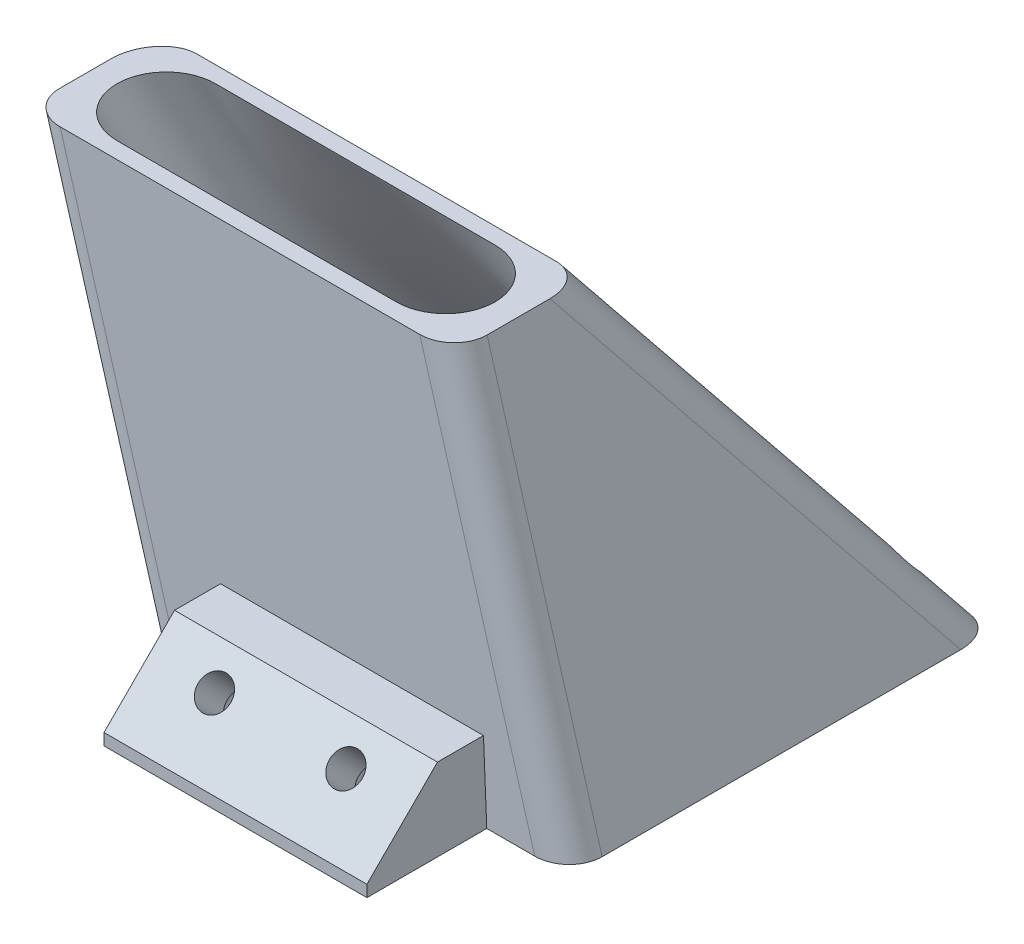
ISO-10303-21;
HEADER;
FILE_DESCRIPTION(('STEP AP214'),'2;1');
FILE_NAME('part.step','',(''),(''),'','','');
FILE_SCHEMA(('AUTOMOTIVE_DESIGN { 1 0 10303 214 1 1 1 1 }'));
ENDSEC;
DATA;
#1=APPLICATION_CONTEXT('core data for automotive mechanical design processes');
#2=APPLICATION_PROTOCOL_DEFINITION('international standard','automotive_design',2000,#1);
#3=PRODUCT_CONTEXT('',#1,'mechanical');
#4=PRODUCT('Part','Part','',(#3));
#5=PRODUCT_RELATED_PRODUCT_CATEGORY('part','',(#4));
#6=PRODUCT_DEFINITION_FORMATION('','',#4);
#7=PRODUCT_DEFINITION_CONTEXT('part definition',#1,'design');
#8=PRODUCT_DEFINITION('design','',#6,#7);
#9=PRODUCT_DEFINITION_SHAPE('','',#8);
#10=(LENGTH_UNIT() NAMED_UNIT(*) SI_UNIT(.MILLI.,.METRE.));
#11=(NAMED_UNIT(*) PLANE_ANGLE_UNIT() SI_UNIT($,.RADIAN.));
#12=(NAMED_UNIT(*) SI_UNIT($,.STERADIAN.) SOLID_ANGLE_UNIT());
#13=UNCERTAINTY_MEASURE_WITH_UNIT(LENGTH_MEASURE(1.E-05),#10,'distance_accuracy_value','');
#14=(GEOMETRIC_REPRESENTATION_CONTEXT(3) GLOBAL_UNCERTAINTY_ASSIGNED_CONTEXT((#13)) GLOBAL_UNIT_ASSIGNED_CONTEXT((#10,
#11,#12)) REPRESENTATION_CONTEXT('',''));
#15=CARTESIAN_POINT('',(0.,0.,0.));
#16=DIRECTION('',(0.,0.,1.));
#17=DIRECTION('',(1.,0.,0.));
#18=AXIS2_PLACEMENT_3D('',#15,#16,#17);
#19=CARTESIAN_POINT('',(0.,25.,0.));
#20=DIRECTION('',(0.,-1.,0.));
#21=DIRECTION('',(0.,0.,-1.));
#22=AXIS2_PLACEMENT_3D('',#19,#20,#21);
#23=PLANE('',#22);
#24=DIRECTION('',(-1.,0.,0.));
#25=VECTOR('',#24,1.);
#26=CARTESIAN_POINT('',(-14.5,25.,12.9999999999999));
#27=LINE('',#26,#25);
#28=CARTESIAN_POINT('',(2.49999999820458,25.,12.9999999999999));
#29=VERTEX_POINT('',#28);
#30=CARTESIAN_POINT('',(-14.5,25.,12.9999999999999));
#31=VERTEX_POINT('',#30);
#32=EDGE_CURVE('E332',#29,#31,#27,.T.);
#33=ORIENTED_EDGE('',*,*,#32,.T.);
#34=CARTESIAN_POINT('',(-14.5,25.,9.99999999999991));
#35=DIRECTION('',(0.,-1.,0.));
#36=DIRECTION('',(0.,0.,1.));
#37=AXIS2_PLACEMENT_3D('',#34,#35,#36);
#38=CIRCLE('',#37,3.00000000000001);
#39=CARTESIAN_POINT('',(-14.4999999998171,25.,6.99999999999991));
#40=VERTEX_POINT('',#39);
#41=EDGE_CURVE('E426',#31,#40,#38,.T.);
#42=ORIENTED_EDGE('',*,*,#41,.T.);
#43=DIRECTION('',(1.,0.,0.));
#44=VECTOR('',#43,1.);
#45=CARTESIAN_POINT('',(-14.5,25.,6.99999999999991));
#46=LINE('',#45,#44);
#47=CARTESIAN_POINT('',(2.49999999999999,25.,6.9999999999999));
#48=VERTEX_POINT('',#47);
#49=EDGE_CURVE('E430',#40,#48,#46,.T.);
#50=ORIENTED_EDGE('',*,*,#49,.T.);
#51=CARTESIAN_POINT('',(2.5,25.,9.99999999999991));
#52=DIRECTION('',(0.,-1.,0.));
#53=DIRECTION('',(0.,0.,1.));
#54=AXIS2_PLACEMENT_3D('',#51,#52,#53);
#55=CIRCLE('',#54,3.00000000000001);
#56=EDGE_CURVE('E425',#48,#29,#55,.T.);
#57=ORIENTED_EDGE('',*,*,#56,.T.);
#58=EDGE_LOOP('',(#33,#42,#50,#57));
#59=FACE_BOUND('',#58,.T.);
#60=DIRECTION('',(-1.,0.,0.));
#61=VECTOR('',#60,1.);
#62=CARTESIAN_POINT('',(7.,25.,13.9999999999999));
#63=LINE('',#62,#61);
#64=CARTESIAN_POINT('',(4.92402172044335,25.,13.9999999999999));
#65=VERTEX_POINT('',#64);
#66=CARTESIAN_POINT('',(-16.9623910372583,25.,13.9999999999999));
#67=VERTEX_POINT('',#66);
#68=EDGE_CURVE('E453',#65,#67,#63,.T.);
#69=ORIENTED_EDGE('',*,*,#68,.F.);
#70=CARTESIAN_POINT('',(4.94320637885081,25.,11.9984006394884));
#71=DIRECTION('',(0.,1.,0.));
#72=DIRECTION('',(-0.986393923832146,0.,0.164398987305344));
#73=AXIS2_PLACEMENT_3D('',#70,#71,#72);
#74=ELLIPSE('',#73,2.05834885284298,2.);
#75=CARTESIAN_POINT('',(7.,25.,11.9797308032904));
#76=VERTEX_POINT('',#75);
#77=EDGE_CURVE('E854',#76,#65,#74,.F.);
#78=ORIENTED_EDGE('',*,*,#77,.F.);
#79=DIRECTION('',(0.,0.,1.));
#80=VECTOR('',#79,1.);
#81=CARTESIAN_POINT('',(7.,25.,13.9999999999999));
#82=LINE('',#81,#80);
#83=CARTESIAN_POINT('',(7.,25.,8.15732406713463));
#84=VERTEX_POINT('',#83);
#85=EDGE_CURVE('E424',#84,#76,#82,.T.);
#86=ORIENTED_EDGE('',*,*,#85,.F.);
#87=CARTESIAN_POINT('',(4.94320637885081,25.,8.51205095489713));
#88=DIRECTION('',(0.,1.,0.));
#89=DIRECTION('',(-0.301131367937099,0.,0.953582665134141));
#90=AXIS2_PLACEMENT_3D('',#87,#88,#89);
#91=ELLIPSE('',#90,2.55749877810332,2.);
#92=CARTESIAN_POINT('',(5.23364634726691,25.,5.99999999999992));
#93=VERTEX_POINT('',#92);
#94=EDGE_CURVE('E857',#93,#84,#91,.F.);
#95=ORIENTED_EDGE('',*,*,#94,.F.);
#96=DIRECTION('',(1.,0.,0.));
#97=VECTOR('',#96,1.);
#98=CARTESIAN_POINT('',(7.,25.,5.99999999999992));
#99=LINE('',#98,#97);
#100=CARTESIAN_POINT('',(-16.6527664104347,25.,5.99999999999992));
#101=VERTEX_POINT('',#100);
#102=EDGE_CURVE('E724',#101,#93,#99,.T.);
#103=ORIENTED_EDGE('',*,*,#102,.F.);
#104=CARTESIAN_POINT('',(-16.9432063788508,25.,8.51205095489712));
#105=DIRECTION('',(0.,1.,0.));
#106=DIRECTION('',(-0.301131367937099,0.,0.953582665134141));
#107=AXIS2_PLACEMENT_3D('',#104,#105,#106);
#108=ELLIPSE('',#107,2.55749877810332,2.);
#109=CARTESIAN_POINT('',(-19.,25.,8.86677784265962));
#110=VERTEX_POINT('',#109);
#111=EDGE_CURVE('E779',#110,#101,#108,.F.);
#112=ORIENTED_EDGE('',*,*,#111,.F.);
#113=DIRECTION('',(0.,0.,-1.));
#114=VECTOR('',#113,1.);
#115=CARTESIAN_POINT('',(-19.,25.,13.9999999999999));
#116=LINE('',#115,#114);
#117=CARTESIAN_POINT('',(-19.,25.,12.0170704756865));
#118=VERTEX_POINT('',#117);
#119=EDGE_CURVE('E721',#118,#110,#116,.T.);
#120=ORIENTED_EDGE('',*,*,#119,.F.);
#121=CARTESIAN_POINT('',(-16.9432063788508,25.,11.9984006394884));
#122=DIRECTION('',(0.,1.,0.));
#123=DIRECTION('',(-0.986393923832146,0.,0.164398987305344));
#124=AXIS2_PLACEMENT_3D('',#121,#122,#123);
#125=ELLIPSE('',#124,2.05834885284298,2.);
#126=EDGE_CURVE('E795',#67,#118,#125,.F.);
#127=ORIENTED_EDGE('',*,*,#126,.F.);
#128=EDGE_LOOP('',(#69,#78,#86,#95,#103,#112,#120,#127));
#129=FACE_BOUND('',#128,.T.);
#130=ADVANCED_FACE('F138',(#59,#129),#23,.F.);
#131=CARTESIAN_POINT('',(0.,0.,0.));
#132=DIRECTION('',(0.,1.,0.));
#133=DIRECTION('',(0.,0.,1.));
#134=AXIS2_PLACEMENT_3D('',#131,#132,#133);
#135=PLANE('',#134);
#136=CARTESIAN_POINT('',(-4.,0.,14.1421356237309));
#137=DIRECTION('',(0.,-1.,0.));
#138=DIRECTION('',(0.,0.,1.));
#139=AXIS2_PLACEMENT_3D('',#136,#137,#138);
#140=ELLIPSE('',#139,2.47487373415291,1.75);
#141=CARTESIAN_POINT('',(-4.,0.,16.6170093578838));
#142=VERTEX_POINT('',#141);
#143=EDGE_CURVE('E568',#142,#142,#140,.T.);
#144=ORIENTED_EDGE('',*,*,#143,.F.);
#145=EDGE_LOOP('',(#144));
#146=FACE_BOUND('',#145,.T.);
#147=CARTESIAN_POINT('',(4.,0.,14.1421356237309));
#148=DIRECTION('',(0.,-1.,0.));
#149=DIRECTION('',(0.,0.,1.));
#150=AXIS2_PLACEMENT_3D('',#147,#148,#149);
#151=ELLIPSE('',#150,2.47487373415291,1.75);
#152=CARTESIAN_POINT('',(4.,0.,16.6170093578838));
#153=VERTEX_POINT('',#152);
#154=EDGE_CURVE('E571',#153,#153,#151,.T.);
#155=ORIENTED_EDGE('',*,*,#154,.F.);
#156=EDGE_LOOP('',(#155));
#157=FACE_BOUND('',#156,.T.);
#158=DIRECTION('',(0.,0.,1.));
#159=VECTOR('',#158,1.);
#160=CARTESIAN_POINT('',(-8.,0.,21.));
#161=LINE('',#160,#159);
#162=CARTESIAN_POINT('',(-8.,0.,13.));
#163=VERTEX_POINT('',#162);
#164=CARTESIAN_POINT('',(-8.,0.,20.2928932188134));
#165=VERTEX_POINT('',#164);
#166=EDGE_CURVE('E265',#163,#165,#161,.T.);
#167=ORIENTED_EDGE('',*,*,#166,.F.);
#168=DIRECTION('',(-1.,0.,0.));
#169=VECTOR('',#168,1.);
#170=CARTESIAN_POINT('',(13.,0.,13.));
#171=LINE('',#170,#169);
#172=CARTESIAN_POINT('',(-10.9623910372583,0.,13.));
#173=VERTEX_POINT('',#172);
#174=EDGE_CURVE('E275',#163,#173,#171,.T.);
#175=ORIENTED_EDGE('',*,*,#174,.T.);
#176=CARTESIAN_POINT('',(-10.9432063788508,0.,10.9984006394885));
#177=DIRECTION('',(0.,-1.,0.));
#178=DIRECTION('',(-0.986393923832146,0.,0.164398987305344));
#179=AXIS2_PLACEMENT_3D('',#176,#177,#178);
#180=ELLIPSE('',#179,2.05834885284298,2.);
#181=CARTESIAN_POINT('',(-13.,0.,11.0170704756865));
#182=VERTEX_POINT('',#181);
#183=EDGE_CURVE('E762',#182,#173,#180,.F.);
#184=ORIENTED_EDGE('',*,*,#183,.F.);
#185=DIRECTION('',(0.,0.,-1.));
#186=VECTOR('',#185,1.);
#187=CARTESIAN_POINT('',(-13.,0.,-13.));
#188=LINE('',#187,#186);
#189=CARTESIAN_POINT('',(-13.,0.,-10.1332221573403));
#190=VERTEX_POINT('',#189);
#191=EDGE_CURVE('E685',#182,#190,#188,.T.);
#192=ORIENTED_EDGE('',*,*,#191,.T.);
#193=CARTESIAN_POINT('',(-10.9432063788508,0.,-10.4879490451028));
#194=DIRECTION('',(0.,-1.,0.));
#195=DIRECTION('',(-0.301131367937099,0.,0.953582665134141));
#196=AXIS2_PLACEMENT_3D('',#193,#194,#195);
#197=ELLIPSE('',#196,2.55749877810332,2.);
#198=CARTESIAN_POINT('',(-10.6527664104347,0.,-13.));
#199=VERTEX_POINT('',#198);
#200=EDGE_CURVE('E757',#199,#190,#197,.F.);
#201=ORIENTED_EDGE('',*,*,#200,.F.);
#202=DIRECTION('',(1.,0.,0.));
#203=VECTOR('',#202,1.);
#204=CARTESIAN_POINT('',(13.,0.,-13.));
#205=LINE('',#204,#203);
#206=CARTESIAN_POINT('',(11.2336463472669,0.,-13.));
#207=VERTEX_POINT('',#206);
#208=EDGE_CURVE('E727',#199,#207,#205,.T.);
#209=ORIENTED_EDGE('',*,*,#208,.T.);
#210=CARTESIAN_POINT('',(10.9432063788508,0.,-10.4879490451028));
#211=DIRECTION('',(0.,-1.,0.));
#212=DIRECTION('',(-0.301131367937099,0.,0.953582665134141));
#213=AXIS2_PLACEMENT_3D('',#210,#211,#212);
#214=ELLIPSE('',#213,2.55749877810332,2.);
#215=CARTESIAN_POINT('',(13.,0.,-10.8426759328653));
#216=VERTEX_POINT('',#215);
#217=EDGE_CURVE('E752',#216,#207,#214,.F.);
#218=ORIENTED_EDGE('',*,*,#217,.F.);
#219=DIRECTION('',(0.,0.,1.));
#220=VECTOR('',#219,1.);
#221=CARTESIAN_POINT('',(13.,0.,-13.));
#222=LINE('',#221,#220);
#223=CARTESIAN_POINT('',(13.,0.,10.9797308032905));
#224=VERTEX_POINT('',#223);
#225=EDGE_CURVE('E286',#216,#224,#222,.T.);
#226=ORIENTED_EDGE('',*,*,#225,.T.);
#227=CARTESIAN_POINT('',(10.9432063788508,0.,10.9984006394885));
#228=DIRECTION('',(0.,-1.,0.));
#229=DIRECTION('',(-0.986393923832146,0.,0.164398987305344));
#230=AXIS2_PLACEMENT_3D('',#227,#228,#229);
#231=ELLIPSE('',#230,2.05834885284298,2.);
#232=CARTESIAN_POINT('',(10.9240217204434,0.,13.));
#233=VERTEX_POINT('',#232);
#234=EDGE_CURVE('E749',#233,#224,#231,.F.);
#235=ORIENTED_EDGE('',*,*,#234,.F.);
#236=CARTESIAN_POINT('',(8.,0.,13.));
#237=VERTEX_POINT('',#236);
#238=EDGE_CURVE('E285',#233,#237,#171,.T.);
#239=ORIENTED_EDGE('',*,*,#238,.T.);
#240=DIRECTION('',(0.,0.,-1.));
#241=VECTOR('',#240,1.);
#242=CARTESIAN_POINT('',(8.,0.,21.));
#243=LINE('',#242,#241);
#244=CARTESIAN_POINT('',(8.,0.,20.2928932188134));
#245=VERTEX_POINT('',#244);
#246=EDGE_CURVE('E297',#245,#237,#243,.T.);
#247=ORIENTED_EDGE('',*,*,#246,.F.);
#248=DIRECTION('',(1.,0.,0.));
#249=VECTOR('',#248,1.);
#250=CARTESIAN_POINT('',(8.,0.,20.2928932188134));
#251=LINE('',#250,#249);
#252=EDGE_CURVE('E295',#165,#245,#251,.T.);
#253=ORIENTED_EDGE('',*,*,#252,.F.);
#254=EDGE_LOOP('',(#167,#175,#184,#192,#201,#209,#218,#226,#235,#239,#247,#253));
#255=FACE_BOUND('',#254,.T.);
#256=CARTESIAN_POINT('',(10.,0.,-10.));
#257=DIRECTION('',(0.,1.,0.));
#258=DIRECTION('',(0.,0.,1.));
#259=AXIS2_PLACEMENT_3D('',#256,#257,#258);
#260=CIRCLE('',#259,0.999999999999999);
#261=CARTESIAN_POINT('',(10.,0.,-9.));
#262=VERTEX_POINT('',#261);
#263=EDGE_CURVE('E307',#262,#262,#260,.T.);
#264=ORIENTED_EDGE('',*,*,#263,.T.);
#265=EDGE_LOOP('',(#264));
#266=FACE_BOUND('',#265,.T.);
#267=CARTESIAN_POINT('',(-10.,0.,-10.));
#268=DIRECTION('',(0.,1.,0.));
#269=DIRECTION('',(0.,0.,-1.));
#270=AXIS2_PLACEMENT_3D('',#267,#268,#269);
#271=CIRCLE('',#270,0.999999999999999);
#272=CARTESIAN_POINT('',(-10.,0.,-11.));
#273=VERTEX_POINT('',#272);
#274=EDGE_CURVE('E311',#273,#273,#271,.T.);
#275=ORIENTED_EDGE('',*,*,#274,.T.);
#276=EDGE_LOOP('',(#275));
#277=FACE_BOUND('',#276,.T.);
#278=CARTESIAN_POINT('',(-10.,0.,10.));
#279=DIRECTION('',(0.,1.,0.));
#280=DIRECTION('',(0.,0.,1.));
#281=AXIS2_PLACEMENT_3D('',#278,#279,#280);
#282=CIRCLE('',#281,0.999999999999999);
#283=CARTESIAN_POINT('',(-10.,0.,11.));
#284=VERTEX_POINT('',#283);
#285=EDGE_CURVE('E319',#284,#284,#282,.T.);
#286=ORIENTED_EDGE('',*,*,#285,.T.);
#287=EDGE_LOOP('',(#286));
#288=FACE_BOUND('',#287,.T.);
#289=CARTESIAN_POINT('',(10.,0.,10.));
#290=DIRECTION('',(0.,1.,0.));
#291=DIRECTION('',(0.,0.,-1.));
#292=AXIS2_PLACEMENT_3D('',#289,#290,#291);
#293=CIRCLE('',#292,0.999999999999999);
#294=CARTESIAN_POINT('',(10.,0.,9.));
#295=VERTEX_POINT('',#294);
#296=EDGE_CURVE('E318',#295,#295,#293,.T.);
#297=ORIENTED_EDGE('',*,*,#296,.T.);
#298=EDGE_LOOP('',(#297));
#299=FACE_BOUND('',#298,.T.);
#300=CARTESIAN_POINT('',(0.,0.,0.));
#301=DIRECTION('',(0.,1.,0.));
#302=DIRECTION('',(0.,0.,-1.));
#303=AXIS2_PLACEMENT_3D('',#300,#301,#302);
#304=CIRCLE('',#303,11.5);
#305=CARTESIAN_POINT('',(10.6402403849438,0.,4.36294448172448));
#306=VERTEX_POINT('',#305);
#307=CARTESIAN_POINT('',(11.0216045895966,0.,-3.28241256861229));
#308=VERTEX_POINT('',#307);
#309=EDGE_CURVE('E419',#306,#308,#304,.T.);
#310=ORIENTED_EDGE('',*,*,#309,.T.);
#311=CARTESIAN_POINT('',(-10.6402403851226,0.,-4.36294448128858));
#312=VERTEX_POINT('',#311);
#313=EDGE_CURVE('E414',#308,#312,#304,.T.);
#314=ORIENTED_EDGE('',*,*,#313,.T.);
#315=CARTESIAN_POINT('',(-11.0216045895966,0.,3.2824125686123));
#316=VERTEX_POINT('',#315);
#317=EDGE_CURVE('E421',#312,#316,#304,.T.);
#318=ORIENTED_EDGE('',*,*,#317,.T.);
#319=EDGE_CURVE('E325',#316,#306,#304,.T.);
#320=ORIENTED_EDGE('',*,*,#319,.T.);
#321=EDGE_LOOP('',(#310,#314,#318,#320));
#322=FACE_BOUND('',#321,.T.);
#323=ADVANCED_FACE('F291',(#146,#157,#255,#266,#277,#288,#299,#322),#135,.F.);
#324=CARTESIAN_POINT('',(-12.2919818456883,-2.95007564296521,0.));
#325=DIRECTION('',(0.972387301980517,0.233372952475325,0.));
#326=DIRECTION('',(0.233372952475325,-0.972387301980517,0.));
#327=AXIS2_PLACEMENT_3D('',#324,#325,#326);
#328=PLANE('',#327);
#329=ORIENTED_EDGE('',*,*,#119,.T.);
#330=DIRECTION('',(-0.187683374126957,0.782014058862319,0.59433068473536));
#331=VECTOR('',#330,1.);
#332=CARTESIAN_POINT('',(-13.6723946437738,2.80164434905737,-8.00397245205671));
#333=LINE('',#332,#331);
#334=EDGE_CURVE('E793',#190,#110,#333,.T.);
#335=ORIENTED_EDGE('',*,*,#334,.F.);
#336=ORIENTED_EDGE('',*,*,#191,.F.);
#337=DIRECTION('',(-0.233196622300942,0.97165259292059,0.0388661037168203));
#338=VECTOR('',#337,1.);
#339=CARTESIAN_POINT('',(-12.1931987570179,-3.36167184575852,10.8826036018562));
#340=LINE('',#339,#338);
#341=EDGE_CURVE('E753',#118,#182,#340,.F.);
#342=ORIENTED_EDGE('',*,*,#341,.F.);
#343=EDGE_LOOP('',(#329,#335,#336,#342));
#344=FACE_BOUND('',#343,.T.);
#345=ADVANCED_FACE('F559',(#344),#328,.F.);
#346=CARTESIAN_POINT('',(0.,-0.519169329073439,12.9792332268371));
#347=DIRECTION('',(0.,0.0399680383488682,-0.999200958721789));
#348=DIRECTION('',(0.,0.99920095872179,0.0399680383488682));
#349=AXIS2_PLACEMENT_3D('',#346,#347,#348);
#350=PLANE('',#349);
#351=ORIENTED_EDGE('',*,*,#238,.F.);
#352=DIRECTION('',(-0.233196622300942,0.97165259292059,0.0388661037168203));
#353=VECTOR('',#352,1.);
#354=CARTESIAN_POINT('',(10.4477909320204,1.98429495176213,13.0793717980705));
#355=LINE('',#354,#353);
#356=EDGE_CURVE('E786',#65,#233,#355,.F.);
#357=ORIENTED_EDGE('',*,*,#356,.F.);
#358=ORIENTED_EDGE('',*,*,#68,.T.);
#359=DIRECTION('',(-0.233196622300942,0.97165259292059,0.0388661037168203));
#360=VECTOR('',#359,1.);
#361=CARTESIAN_POINT('',(-10.2484241530569,-2.97486201750561,12.8810055192998));
#362=LINE('',#361,#360);
#363=EDGE_CURVE('E280',#173,#67,#362,.T.);
#364=ORIENTED_EDGE('',*,*,#363,.F.);
#365=ORIENTED_EDGE('',*,*,#174,.F.);
#366=DIRECTION('',(0.,-0.99920095872179,-0.0399680383488682));
#367=VECTOR('',#366,1.);
#368=CARTESIAN_POINT('',(-8.,-0.519169329073439,12.9792332268371));
#369=LINE('',#368,#367);
#370=CARTESIAN_POINT('',(-8.,5.,13.2));
#371=VERTEX_POINT('',#370);
#372=EDGE_CURVE('E260',#371,#163,#369,.T.);
#373=ORIENTED_EDGE('',*,*,#372,.F.);
#374=DIRECTION('',(1.,0.,0.));
#375=VECTOR('',#374,1.);
#376=CARTESIAN_POINT('',(0.,5.,13.2));
#377=LINE('',#376,#375);
#378=CARTESIAN_POINT('',(8.,5.,13.2));
#379=VERTEX_POINT('',#378);
#380=EDGE_CURVE('E272',#371,#379,#377,.T.);
#381=ORIENTED_EDGE('',*,*,#380,.T.);
#382=DIRECTION('',(0.,0.99920095872179,0.0399680383488682));
#383=VECTOR('',#382,1.);
#384=CARTESIAN_POINT('',(8.,-0.519169329073439,12.9792332268371));
#385=LINE('',#384,#383);
#386=EDGE_CURVE('E271',#237,#379,#385,.T.);
#387=ORIENTED_EDGE('',*,*,#386,.F.);
#388=EDGE_LOOP('',(#351,#357,#358,#364,#365,#373,#381,#387));
#389=FACE_BOUND('',#388,.T.);
#390=ADVANCED_FACE('F278',(#389),#350,.F.);
#391=CARTESIAN_POINT('',(0.,6.26267748478701,-8.24036511156189));
#392=DIRECTION('',(0.,-0.605083267533556,0.796162194123104));
#393=DIRECTION('',(0.,-0.796162194123104,-0.605083267533556));
#394=AXIS2_PLACEMENT_3D('',#391,#392,#393);
#395=PLANE('',#394);
#396=ORIENTED_EDGE('',*,*,#102,.T.);
#397=DIRECTION('',(-0.187683374126957,0.782014058862319,0.59433068473536));
#398=VECTOR('',#397,1.);
#399=CARTESIAN_POINT('',(9.38784275773501,7.69084828971628,-7.15495529981566));
#400=LINE('',#399,#398);
#401=CARTESIAN_POINT('',(9.97062473032492,5.26259007059165,-9.00043154635037));
#402=VERTEX_POINT('',#401);
#403=EDGE_CURVE('E766',#402,#93,#400,.T.);
#404=ORIENTED_EDGE('',*,*,#403,.F.);
#405=CARTESIAN_POINT('',(10.,3.94736842105265,-10.));
#406=DIRECTION('',(0.,0.605083267533556,-0.796162194123104));
#407=DIRECTION('',(0.,-0.796162194123104,-0.605083267533556));
#408=AXIS2_PLACEMENT_3D('',#405,#406,#407);
#409=ELLIPSE('',#408,1.65266510190606,0.999999999999999);
#410=CARTESIAN_POINT('',(10.5500116997172,2.84847769812395,-10.8351569494258));
#411=VERTEX_POINT('',#410);
#412=EDGE_CURVE('E310',#411,#402,#409,.T.);
#413=ORIENTED_EDGE('',*,*,#412,.F.);
#414=DIRECTION('',(-0.187683374126957,0.782014058862319,0.59433068473536));
#415=VECTOR('',#414,1.);
#416=CARTESIAN_POINT('',(9.38784275773501,7.69084828971628,-7.15495529981566));
#417=LINE('',#416,#415);
#418=EDGE_CURVE('E770',#207,#411,#417,.T.);
#419=ORIENTED_EDGE('',*,*,#418,.F.);
#420=ORIENTED_EDGE('',*,*,#208,.F.);
#421=DIRECTION('',(-0.187683374126957,0.782014058862319,0.59433068473536));
#422=VECTOR('',#421,1.);
#423=CARTESIAN_POINT('',(-11.7276200398127,4.47855678907513,-9.59629684030292));
#424=LINE('',#423,#422);
#425=EDGE_CURVE('E655',#101,#199,#424,.F.);
#426=ORIENTED_EDGE('',*,*,#425,.F.);
#427=EDGE_LOOP('',(#396,#404,#413,#419,#420,#426));
#428=FACE_BOUND('',#427,.T.);
#429=CARTESIAN_POINT('',(-10.,3.94736842105265,-10.));
#430=DIRECTION('',(0.,0.605083267533556,-0.796162194123104));
#431=DIRECTION('',(0.,-0.796162194123104,-0.605083267533556));
#432=AXIS2_PLACEMENT_3D('',#429,#430,#431);
#433=ELLIPSE('',#432,1.65266510190606,0.999999999999999);
#434=CARTESIAN_POINT('',(-10.,2.63157894736844,-11.));
#435=VERTEX_POINT('',#434);
#436=EDGE_CURVE('E314',#435,#435,#433,.T.);
#437=ORIENTED_EDGE('',*,*,#436,.F.);
#438=EDGE_LOOP('',(#437));
#439=FACE_BOUND('',#438,.T.);
#440=ADVANCED_FACE('F783',(#428,#439),#395,.F.);
#441=CARTESIAN_POINT('',(12.2919818456884,2.95007564296521,0.));
#442=DIRECTION('',(-0.972387301980517,-0.233372952475324,0.));
#443=DIRECTION('',(-0.233372952475324,0.972387301980517,0.));
#444=AXIS2_PLACEMENT_3D('',#441,#442,#443);
#445=PLANE('',#444);
#446=ORIENTED_EDGE('',*,*,#85,.T.);
#447=DIRECTION('',(-0.233196622300942,0.97165259292059,0.0388661037168203));
#448=VECTOR('',#447,1.);
#449=CARTESIAN_POINT('',(12.3925655359815,2.53097693341052,11.0809698806269));
#450=LINE('',#449,#448);
#451=EDGE_CURVE('E654',#224,#76,#450,.T.);
#452=ORIENTED_EDGE('',*,*,#451,.F.);
#453=ORIENTED_EDGE('',*,*,#225,.F.);
#454=DIRECTION('',(-0.187683374126957,0.782014058862319,0.59433068473536));
#455=VECTOR('',#454,1.);
#456=CARTESIAN_POINT('',(11.332617361696,6.94742765959981,-5.56263091156945));
#457=LINE('',#456,#455);
#458=EDGE_CURVE('E708',#84,#216,#457,.F.);
#459=ORIENTED_EDGE('',*,*,#458,.F.);
#460=EDGE_LOOP('',(#446,#452,#453,#459));
#461=FACE_BOUND('',#460,.T.);
#462=ADVANCED_FACE('F351',(#461),#445,.F.);
#463=CARTESIAN_POINT('',(2.49999999820458,25.,12.9999999999999));
#464=CARTESIAN_POINT('',(10.6402403849438,0.,4.36294448172448));
#465=CARTESIAN_POINT('',(2.81526125219568,25.,12.9999999999999));
#466=CARTESIAN_POINT('',(10.8037671362267,0.,3.96413951170701));
#467=CARTESIAN_POINT('',(3.48518305167077,25.0000000000001,12.9006204718999));
#468=CARTESIAN_POINT('',(11.0413822433789,0.,3.26632807008249));
#469=CARTESIAN_POINT('',(4.49375113023656,24.9999999999999,12.3482025138626));
#470=CARTESIAN_POINT('',(11.2754621249926,0.,2.3253907760856));
#471=CARTESIAN_POINT('',(5.29167901815688,25.0000000000001,11.3415272283433));
#472=CARTESIAN_POINT('',(11.420477177352,0.,1.43974941400559));
#473=CARTESIAN_POINT('',(5.60497729700984,25.,9.99999999999994));
#474=CARTESIAN_POINT('',(11.4967524390815,0.,0.573481706152424));
#475=CARTESIAN_POINT('',(5.29167901815686,25.,8.6584727716565));
#476=CARTESIAN_POINT('',(11.5071086948946,0.,-0.296015988010232));
#477=CARTESIAN_POINT('',(4.49375113023657,25.,7.65179748613722));
#478=CARTESIAN_POINT('',(11.4508849452292,0.,-1.19179242928072));
#479=CARTESIAN_POINT('',(3.48518305167076,25.,7.09937952809989));
#480=CARTESIAN_POINT('',(11.311633740644,0.,-2.15130198351375));
#481=CARTESIAN_POINT('',(2.81526125219568,25.,6.99999999999991));
#482=CARTESIAN_POINT('',(11.1446321150282,0.,-2.86931375467572));
#483=CARTESIAN_POINT('',(1.71422883967938,25.,6.99999999999991));
#484=CARTESIAN_POINT('',(10.7149653178397,0.,-4.31203841067227));
#485=CARTESIAN_POINT('',(0.209201496978708,25.,6.99999999999991));
#486=CARTESIAN_POINT('',(9.7915212882665,0.,-6.3504391194931));
#487=CARTESIAN_POINT('',(-1.91555403210623,25.,6.99999999999991));
#488=CARTESIAN_POINT('',(7.4463321081483,0.,-9.00875305051836));
#489=CARTESIAN_POINT('',(-3.97428352508072,25.,6.99999999999991));
#490=CARTESIAN_POINT('',(4.2714417090761,0.,-10.8924885301232));
#491=CARTESIAN_POINT('',(-6.,25.,6.9999999999999));
#492=CARTESIAN_POINT('',(0.583125068405685,0.,-11.6901358344804));
#493=CARTESIAN_POINT('',(-8.02571647491928,25.,6.9999999999999));
#494=CARTESIAN_POINT('',(-3.16626129480691,0.,-11.2634945761033));
#495=CARTESIAN_POINT('',(-10.0844459678938,25.,6.99999999999991));
#496=CARTESIAN_POINT('',(-6.51285322727913,0.,-9.70506240216845));
#497=CARTESIAN_POINT('',(-12.2092014969787,25.,6.99999999999991));
#498=CARTESIAN_POINT('',(-9.11094555278082,0.,-7.29332827200502));
#499=CARTESIAN_POINT('',(-13.7142288396794,25.,6.99999999999991));
#500=CARTESIAN_POINT('',(-10.2326590435049,0.,-5.35694371045648));
#501=CARTESIAN_POINT('',(-14.8152612521957,25.,6.99999999999991));
#502=CARTESIAN_POINT('',(-10.8037671362267,0.,-3.96413951170701));
#503=CARTESIAN_POINT('',(-15.4851830516708,25.,7.09937952809991));
#504=CARTESIAN_POINT('',(-11.0413822433789,0.,-3.26632807008248));
#505=CARTESIAN_POINT('',(-16.4937511302366,25.,7.65179748613718));
#506=CARTESIAN_POINT('',(-11.2754621249926,0.,-2.3253907760856));
#507=CARTESIAN_POINT('',(-17.2916790181569,25.,8.65847277165655));
#508=CARTESIAN_POINT('',(-11.420477177352,0.,-1.43974941400558));
#509=CARTESIAN_POINT('',(-17.6049772970098,25.,9.99999999999989));
#510=CARTESIAN_POINT('',(-11.4967524390815,0.,-0.573481706152415));
#511=CARTESIAN_POINT('',(-17.2916790181569,25.,11.3415272283433));
#512=CARTESIAN_POINT('',(-11.5071086948946,0.,0.296015988010235));
#513=CARTESIAN_POINT('',(-16.4937511302365,25.,12.3482025138626));
#514=CARTESIAN_POINT('',(-11.4508849452292,0.,1.19179242928073));
#515=CARTESIAN_POINT('',(-15.4851830516708,25.,12.9006204718999));
#516=CARTESIAN_POINT('',(-11.311633740644,0.,2.15130198351375));
#517=CARTESIAN_POINT('',(-14.8152612521957,25.,12.9999999999999));
#518=CARTESIAN_POINT('',(-11.1446321150282,0.,2.86931375467572));
#519=CARTESIAN_POINT('',(-13.7142288396794,25.,12.9999999999999));
#520=CARTESIAN_POINT('',(-10.7149653178397,0.,4.31203841067227));
#521=CARTESIAN_POINT('',(-12.2092014969787,25.,12.9999999999999));
#522=CARTESIAN_POINT('',(-9.79152128826649,0.,6.35043911949313));
#523=CARTESIAN_POINT('',(-10.0844459678938,25.,12.9999999999999));
#524=CARTESIAN_POINT('',(-7.4463321081483,0.,9.00875305051834));
#525=CARTESIAN_POINT('',(-8.02571647491927,25.,12.9999999999999));
#526=CARTESIAN_POINT('',(-4.27144170907609,0.,10.8924885301233));
#527=CARTESIAN_POINT('',(-6.00000000000001,25.,12.9999999999999));
#528=CARTESIAN_POINT('',(-0.58312506840568,0.,11.6901358344804));
#529=CARTESIAN_POINT('',(-3.97428352508073,25.,12.9999999999999));
#530=CARTESIAN_POINT('',(3.16626129480693,0.,11.2634945761033));
#531=CARTESIAN_POINT('',(-1.91555403210623,25.,12.9999999999999));
#532=CARTESIAN_POINT('',(6.51285322727912,0.,9.70506240216842));
#533=CARTESIAN_POINT('',(0.209201496978711,25.,12.9999999999999));
#534=CARTESIAN_POINT('',(9.11094555278084,0.,7.29332827200504));
#535=CARTESIAN_POINT('',(1.71422883967938,25.,12.9999999999999));
#536=CARTESIAN_POINT('',(10.2326590435049,0.,5.35694371045648));
#537=CARTESIAN_POINT('',(2.49999999820458,25.,12.9999999999999));
#538=CARTESIAN_POINT('',(10.6402403849438,0.,4.36294448172448));
#539=B_SPLINE_SURFACE_WITH_KNOTS('',3,1,((#463,#464),(#465,#466),(#467,#468),(#469,#470),(#471,
#472),(#473,#474),(#475,#476),(#477,#478),(#479,#480),(#481,#482),(#483,#484),(#485,#486),(#487,
#488),(#489,#490),(#491,#492),(#493,#494),(#495,#496),(#497,#498),(#499,#500),(#501,#502),(#503,
#504),(#505,#506),(#507,#508),(#509,#510),(#511,#512),(#513,#514),(#515,#516),(#517,#518),(#519,
#520),(#521,#522),(#523,#524),(#525,#526),(#527,#528),(#529,#530),(#531,#532),(#533,#534),(#535,
#536),(#537,#538)),.UNSPECIFIED.,.T.,.F.,.F.,(4,1,1,1,1,1,1,1,2,1,1,1,1,1,1,1,2,1,1,1,1,1,1,1,2,
1,1,1,1,1,1,1,4),(2,2),(0.,0.0178957750475415,0.035791550095083,0.0536873251426245,
0.071583100190166,0.0894788752377075,0.107374650285249,0.125270425332791,0.143166200380332,
0.187770425332791,0.232374650285249,0.276978875237708,0.321583100190166,0.366187325142625,
0.410791550095083,0.455395775047541,0.5,0.517895775047541,0.535791550095083,0.553687325142625,
0.571583100190166,0.589478875237708,0.607374650285249,0.625270425332791,0.643166200380332,
0.687770425332791,0.732374650285249,0.776978875237708,0.821583100190166,0.866187325142624,
0.910791550095083,0.955395775047541,1.),(0.,1.),.UNSPECIFIED.);
#540=ORIENTED_EDGE('',*,*,#56,.F.);
#541=ORIENTED_EDGE('',*,*,#49,.F.);
#542=ORIENTED_EDGE('',*,*,#41,.F.);
#543=ORIENTED_EDGE('',*,*,#32,.F.);
#544=EDGE_LOOP('',(#540,#541,#542,#543));
#545=FACE_BOUND('',#544,.T.);
#546=ORIENTED_EDGE('',*,*,#319,.F.);
#547=ORIENTED_EDGE('',*,*,#317,.F.);
#548=ORIENTED_EDGE('',*,*,#313,.F.);
#549=ORIENTED_EDGE('',*,*,#309,.F.);
#550=EDGE_LOOP('',(#546,#547,#548,#549));
#551=FACE_BOUND('',#550,.T.);
#552=ADVANCED_FACE('F338',(#545,#551),#539,.T.);
#553=CARTESIAN_POINT('',(10.,6.,10.));
#554=DIRECTION('',(0.,-1.,0.));
#555=DIRECTION('',(0.,0.,-1.));
#556=AXIS2_PLACEMENT_3D('',#553,#554,#555);
#557=CYLINDRICAL_SURFACE('',#556,0.999999999999999);
#558=CARTESIAN_POINT('',(10.,6.,10.));
#559=DIRECTION('',(0.,1.,0.));
#560=DIRECTION('',(0.,0.,-1.));
#561=AXIS2_PLACEMENT_3D('',#558,#559,#560);
#562=CIRCLE('',#561,0.999999999999999);
#563=CARTESIAN_POINT('',(10.,6.,9.));
#564=VERTEX_POINT('',#563);
#565=EDGE_CURVE('E322',#564,#564,#562,.T.);
#566=ORIENTED_EDGE('',*,*,#565,.T.);
#567=EDGE_LOOP('',(#566));
#568=FACE_BOUND('',#567,.T.);
#569=ORIENTED_EDGE('',*,*,#296,.F.);
#570=EDGE_LOOP('',(#569));
#571=FACE_BOUND('',#570,.T.);
#572=ADVANCED_FACE('F350',(#568,#571),#557,.F.);
#573=CARTESIAN_POINT('',(10.,6.,10.));
#574=DIRECTION('',(0.,-1.,0.));
#575=DIRECTION('',(0.,0.,-1.));
#576=AXIS2_PLACEMENT_3D('',#573,#574,#575);
#577=PLANE('',#576);
#578=ORIENTED_EDGE('',*,*,#565,.F.);
#579=EDGE_LOOP('',(#578));
#580=FACE_BOUND('',#579,.T.);
#581=ADVANCED_FACE('F1009',(#580),#577,.T.);
#582=CARTESIAN_POINT('',(-10.,6.,10.));
#583=DIRECTION('',(0.,-1.,0.));
#584=DIRECTION('',(0.,0.,-1.));
#585=AXIS2_PLACEMENT_3D('',#582,#583,#584);
#586=CYLINDRICAL_SURFACE('',#585,0.999999999999999);
#587=CARTESIAN_POINT('',(-10.,6.,10.));
#588=DIRECTION('',(0.,1.,0.));
#589=DIRECTION('',(0.,0.,1.));
#590=AXIS2_PLACEMENT_3D('',#587,#588,#589);
#591=CIRCLE('',#590,0.999999999999999);
#592=CARTESIAN_POINT('',(-10.,6.,11.));
#593=VERTEX_POINT('',#592);
#594=EDGE_CURVE('E315',#593,#593,#591,.T.);
#595=ORIENTED_EDGE('',*,*,#594,.T.);
#596=EDGE_LOOP('',(#595));
#597=FACE_BOUND('',#596,.T.);
#598=ORIENTED_EDGE('',*,*,#285,.F.);
#599=EDGE_LOOP('',(#598));
#600=FACE_BOUND('',#599,.T.);
#601=ADVANCED_FACE('F1000',(#597,#600),#586,.F.);
#602=CARTESIAN_POINT('',(-10.,6.,10.));
#603=DIRECTION('',(0.,1.,0.));
#604=DIRECTION('',(0.,0.,1.));
#605=AXIS2_PLACEMENT_3D('',#602,#603,#604);
#606=PLANE('',#605);
#607=ORIENTED_EDGE('',*,*,#594,.F.);
#608=EDGE_LOOP('',(#607));
#609=FACE_BOUND('',#608,.T.);
#610=ADVANCED_FACE('F991',(#609),#606,.F.);
#611=CARTESIAN_POINT('',(-10.,6.,-10.));
#612=DIRECTION('',(0.,-1.,0.));
#613=DIRECTION('',(0.,0.,-1.));
#614=AXIS2_PLACEMENT_3D('',#611,#612,#613);
#615=CYLINDRICAL_SURFACE('',#614,0.999999999999999);
#616=ORIENTED_EDGE('',*,*,#274,.F.);
#617=EDGE_LOOP('',(#616));
#618=FACE_BOUND('',#617,.T.);
#619=ORIENTED_EDGE('',*,*,#436,.T.);
#620=EDGE_LOOP('',(#619));
#621=FACE_BOUND('',#620,.T.);
#622=ADVANCED_FACE('F643',(#618,#621),#615,.F.);
#623=CARTESIAN_POINT('',(10.,6.,-10.));
#624=DIRECTION('',(0.,-1.,0.));
#625=DIRECTION('',(0.,0.,-1.));
#626=AXIS2_PLACEMENT_3D('',#623,#624,#625);
#627=CYLINDRICAL_SURFACE('',#626,0.999999999999999);
#628=ORIENTED_EDGE('',*,*,#263,.F.);
#629=EDGE_LOOP('',(#628));
#630=FACE_BOUND('',#629,.T.);
#631=ORIENTED_EDGE('',*,*,#412,.T.);
#632=CARTESIAN_POINT('',(10.5500116997172,2.84847769812395,-10.8351569494258));
#633=CARTESIAN_POINT('',(10.5788239139958,2.87343642628271,-10.8161920261472));
#634=CARTESIAN_POINT('',(10.6064317730649,2.89873084798667,-10.7958640477968));
#635=CARTESIAN_POINT('',(10.6590331002062,2.95000394815738,-10.7528769451434));
#636=CARTESIAN_POINT('',(10.6840282549696,2.97598217144806,-10.7302193437608));
#637=CARTESIAN_POINT('',(10.7311014474035,3.02851746641046,-10.6830774936545));
#638=CARTESIAN_POINT('',(10.7531953478815,3.05507037886825,-10.6586044304721));
#639=CARTESIAN_POINT('',(10.7945240961406,3.10891183016467,-10.6081096348499));
#640=CARTESIAN_POINT('',(10.8137585270428,3.13620047558126,-10.5820876773712));
#641=CARTESIAN_POINT('',(10.8683996310098,3.22126625893824,-10.5002778452213));
#642=CARTESIAN_POINT('',(10.8989952147546,3.28031837380697,-10.442530452223));
#643=CARTESIAN_POINT('',(10.9478266844526,3.40156725754495,-10.3250950519479));
#644=CARTESIAN_POINT('',(10.96604582785,3.46376816436336,-10.2654045299138));
#645=CARTESIAN_POINT('',(10.9873746633124,3.57207100437958,-10.1640921287812));
#646=CARTESIAN_POINT('',(10.993355605723,3.61751154062403,-10.1223325367642));
#647=CARTESIAN_POINT('',(11.0000750902068,3.70954136540859,-10.0396367885982));
#648=CARTESIAN_POINT('',(11.0008118134589,3.75613104687876,-9.99870092304504));
#649=CARTESIAN_POINT('',(10.9974530340749,3.85032573698649,-9.91800674590913));
#650=CARTESIAN_POINT('',(10.9933460518303,3.89793289405321,-9.87825146161343));
#651=CARTESIAN_POINT('',(10.9806521174629,3.99382156874402,-9.80029678646162));
#652=CARTESIAN_POINT('',(10.9720645512239,4.04210317792655,-9.7620976096621));
#653=CARTESIAN_POINT('',(10.9505119999591,4.13989943365916,-9.68681269625128));
#654=CARTESIAN_POINT('',(10.9374754536246,4.18942112534973,-9.64975670780892));
#655=CARTESIAN_POINT('',(10.9072490384789,4.28858113329355,-9.57759101041986));
#656=CARTESIAN_POINT('',(10.8900608117753,4.33821939577174,-9.54248053869949));
#657=CARTESIAN_POINT('',(10.8516220461922,4.43715619809844,-9.47439137606552));
#658=CARTESIAN_POINT('',(10.8303832805088,4.4864553037249,-9.44140686877035));
#659=CARTESIAN_POINT('',(10.7836755615916,4.58445980236253,-9.37757066943486));
#660=CARTESIAN_POINT('',(10.7582056225344,4.63316505416605,-9.34671947681466));
#661=CARTESIAN_POINT('',(10.7057625609276,4.72407871042618,-9.29062970559592));
#662=CARTESIAN_POINT('',(10.6792659818577,4.76641064363831,-9.26514754067514));
#663=CARTESIAN_POINT('',(10.6222457733922,4.84950692250731,-9.21627840553556));
#664=CARTESIAN_POINT('',(10.5917261508627,4.89027277644651,-9.19288938899784));
#665=CARTESIAN_POINT('',(10.5257078551898,4.96965563210391,-9.14839381184824));
#666=CARTESIAN_POINT('',(10.4901694021936,5.00825163764686,-9.12730813968772));
#667=CARTESIAN_POINT('',(10.413352859629,5.08119653923095,-9.08841398694556));
#668=CARTESIAN_POINT('',(10.3720896998688,5.11555605727788,-9.07059725310275));
#669=CARTESIAN_POINT('',(10.3027081009237,5.16314048133199,-9.04655947178042));
#670=CARTESIAN_POINT('',(10.2769432058968,5.17895347250621,-9.0387122695148));
#671=CARTESIAN_POINT('',(10.2232251846955,5.20739977729622,-9.02483954238131));
#672=CARTESIAN_POINT('',(10.1952738659129,5.22003568156032,-9.01881253248701));
#673=CARTESIAN_POINT('',(10.1418493761641,5.23938624509896,-9.00980010257502));
#674=CARTESIAN_POINT('',(10.1166569339234,5.24671292740071,-9.00648931683017));
#675=CARTESIAN_POINT('',(10.0653132376588,5.2575142855595,-9.00180616259444));
#676=CARTESIAN_POINT('',(10.0391648884961,5.26099976813465,-9.00042835292449));
#677=CARTESIAN_POINT('',(9.9988258535756,5.26305185013007,-8.99989825652859));
#678=CARTESIAN_POINT('',(9.98470843869359,5.2631493019418,-9.00001058162325));
#679=CARTESIAN_POINT('',(9.97062473032492,5.26259007059165,-9.00043154635037));
#680=B_SPLINE_CURVE_WITH_KNOTS('',3,(#632,#633,#634,#635,#636,#637,#638,#639,#640,#641,#642,
#643,#644,#645,#646,#647,#648,#649,#650,#651,#652,#653,#654,#655,#656,#657,#658,#659,#660,#661,
#662,#663,#664,#665,#666,#667,#668,#669,#670,#671,#672,#673,#674,#675,#676,#677,#678,#679),
.UNSPECIFIED.,.F.,.F.,(4,2,2,2,2,2,2,2,2,2,2,2,2,2,2,2,2,2,2,2,2,2,2,4),(0.,0.127673360425553,
0.255263782611794,0.382124644619518,0.509003983438166,0.772119545913059,1.03559033984527,
1.221368465351,1.40721102002698,1.59349490912447,1.77980433730885,1.96926401883608,
2.15864888603388,2.34749145749369,2.53637808935529,2.70440738815293,2.87227058026046,
3.04154793153088,3.21039183462021,3.30387297364781,3.39727763760685,3.47630606094317,
3.55511157591557,3.59740267835264),.UNSPECIFIED.);
#681=EDGE_CURVE('E647',#411,#402,#680,.T.);
#682=ORIENTED_EDGE('',*,*,#681,.F.);
#683=EDGE_LOOP('',(#631,#682));
#684=FACE_BOUND('',#683,.T.);
#685=ADVANCED_FACE('F639',(#630,#684),#627,.F.);
#686=CARTESIAN_POINT('',(-10.2484241530569,-2.89492594080787,10.8826036018562));
#687=DIRECTION('',(-0.233196622300942,0.971652592920589,0.0388661037168203));
#688=DIRECTION('',(0.972387301980517,0.233372952475325,0.));
#689=AXIS2_PLACEMENT_3D('',#686,#687,#688);
#690=CYLINDRICAL_SURFACE('',#689,2.);
#691=ORIENTED_EDGE('',*,*,#183,.T.);
#692=ORIENTED_EDGE('',*,*,#363,.T.);
#693=ORIENTED_EDGE('',*,*,#126,.T.);
#694=ORIENTED_EDGE('',*,*,#341,.T.);
#695=EDGE_LOOP('',(#691,#692,#693,#694));
#696=FACE_BOUND('',#695,.T.);
#697=ADVANCED_FACE('F476',(#696),#690,.T.);
#698=CARTESIAN_POINT('',(-11.7276200398127,3.26839025400802,-8.00397245205671));
#699=DIRECTION('',(-0.187683374126957,0.782014058862319,0.59433068473536));
#700=DIRECTION('',(0.,-0.605083267533556,0.796162194123104));
#701=AXIS2_PLACEMENT_3D('',#698,#699,#700);
#702=CYLINDRICAL_SURFACE('',#701,2.);
#703=ORIENTED_EDGE('',*,*,#200,.T.);
#704=ORIENTED_EDGE('',*,*,#334,.T.);
#705=ORIENTED_EDGE('',*,*,#111,.T.);
#706=ORIENTED_EDGE('',*,*,#425,.T.);
#707=EDGE_LOOP('',(#703,#704,#705,#706));
#708=FACE_BOUND('',#707,.T.);
#709=ADVANCED_FACE('F663',(#708),#702,.T.);
#710=CARTESIAN_POINT('',(9.38784275773501,6.48068175464917,-5.56263091156945));
#711=DIRECTION('',(-0.187683374126957,0.782014058862319,0.59433068473536));
#712=DIRECTION('',(0.,-0.605083267533556,0.796162194123104));
#713=AXIS2_PLACEMENT_3D('',#710,#711,#712);
#714=CYLINDRICAL_SURFACE('',#713,2.);
#715=ORIENTED_EDGE('',*,*,#217,.T.);
#716=ORIENTED_EDGE('',*,*,#418,.T.);
#717=ORIENTED_EDGE('',*,*,#681,.T.);
#718=ORIENTED_EDGE('',*,*,#403,.T.);
#719=ORIENTED_EDGE('',*,*,#94,.T.);
#720=ORIENTED_EDGE('',*,*,#458,.T.);
#721=EDGE_LOOP('',(#715,#716,#717,#718,#719,#720));
#722=FACE_BOUND('',#721,.T.);
#723=ADVANCED_FACE('F659',(#722),#714,.T.);
#724=CARTESIAN_POINT('',(10.4477909320204,2.06423102845987,11.0809698806269));
#725=DIRECTION('',(-0.233196622300942,0.97165259292059,0.0388661037168203));
#726=DIRECTION('',(0.972387301980518,0.233372952475324,0.));
#727=AXIS2_PLACEMENT_3D('',#724,#725,#726);
#728=CYLINDRICAL_SURFACE('',#727,2.);
#729=ORIENTED_EDGE('',*,*,#234,.T.);
#730=ORIENTED_EDGE('',*,*,#451,.T.);
#731=ORIENTED_EDGE('',*,*,#77,.T.);
#732=ORIENTED_EDGE('',*,*,#356,.T.);
#733=EDGE_LOOP('',(#729,#730,#731,#732));
#734=FACE_BOUND('',#733,.T.);
#735=ADVANCED_FACE('F637',(#734),#728,.T.);
#736=CARTESIAN_POINT('',(8.,5.,21.));
#737=DIRECTION('',(1.,0.,0.));
#738=DIRECTION('',(0.,0.,1.));
#739=AXIS2_PLACEMENT_3D('',#736,#737,#738);
#740=PLANE('',#739);
#741=ORIENTED_EDGE('',*,*,#246,.T.);
#742=ORIENTED_EDGE('',*,*,#386,.T.);
#743=DIRECTION('',(0.,0.,-1.));
#744=VECTOR('',#743,1.);
#745=CARTESIAN_POINT('',(8.,5.,21.));
#746=LINE('',#745,#744);
#747=CARTESIAN_POINT('',(8.,5.,16.));
#748=VERTEX_POINT('',#747);
#749=EDGE_CURVE('E296',#748,#379,#746,.T.);
#750=ORIENTED_EDGE('',*,*,#749,.F.);
#751=DIRECTION('',(0.,0.707106781186547,-0.707106781186549));
#752=VECTOR('',#751,1.);
#753=CARTESIAN_POINT('',(8.,2.5,18.5));
#754=LINE('',#753,#752);
#755=CARTESIAN_POINT('',(8.,0.707106781186559,20.2928932188135));
#756=VERTEX_POINT('',#755);
#757=EDGE_CURVE('E675',#756,#748,#754,.T.);
#758=ORIENTED_EDGE('',*,*,#757,.F.);
#759=DIRECTION('',(0.,1.,0.));
#760=VECTOR('',#759,1.);
#761=CARTESIAN_POINT('',(8.,5.,20.2928932188135));
#762=LINE('',#761,#760);
#763=EDGE_CURVE('E890',#245,#756,#762,.T.);
#764=ORIENTED_EDGE('',*,*,#763,.F.);
#765=EDGE_LOOP('',(#741,#742,#750,#758,#764));
#766=FACE_BOUND('',#765,.T.);
#767=ADVANCED_FACE('F634',(#766),#740,.T.);
#768=CARTESIAN_POINT('',(-8.,5.,21.));
#769=DIRECTION('',(-1.,0.,0.));
#770=DIRECTION('',(0.,0.,-1.));
#771=AXIS2_PLACEMENT_3D('',#768,#769,#770);
#772=PLANE('',#771);
#773=DIRECTION('',(0.,-0.707106781186547,0.707106781186549));
#774=VECTOR('',#773,1.);
#775=CARTESIAN_POINT('',(-8.,2.5,18.5));
#776=LINE('',#775,#774);
#777=CARTESIAN_POINT('',(-8.,5.,16.));
#778=VERTEX_POINT('',#777);
#779=CARTESIAN_POINT('',(-8.,0.70710678118656,20.2928932188135));
#780=VERTEX_POINT('',#779);
#781=EDGE_CURVE('E680',#778,#780,#776,.T.);
#782=ORIENTED_EDGE('',*,*,#781,.F.);
#783=DIRECTION('',(0.,0.,1.));
#784=VECTOR('',#783,1.);
#785=CARTESIAN_POINT('',(-8.,5.,21.));
#786=LINE('',#785,#784);
#787=EDGE_CURVE('E267',#371,#778,#786,.T.);
#788=ORIENTED_EDGE('',*,*,#787,.F.);
#789=ORIENTED_EDGE('',*,*,#372,.T.);
#790=ORIENTED_EDGE('',*,*,#166,.T.);
#791=DIRECTION('',(0.,-1.,0.));
#792=VECTOR('',#791,1.);
#793=CARTESIAN_POINT('',(-8.,5.,20.2928932188135));
#794=LINE('',#793,#792);
#795=EDGE_CURVE('E12',#780,#165,#794,.T.);
#796=ORIENTED_EDGE('',*,*,#795,.F.);
#797=EDGE_LOOP('',(#782,#788,#789,#790,#796));
#798=FACE_BOUND('',#797,.T.);
#799=ADVANCED_FACE('F263',(#798),#772,.T.);
#800=CARTESIAN_POINT('',(0.,5.,0.));
#801=DIRECTION('',(0.,-1.,0.));
#802=DIRECTION('',(0.,0.,-1.));
#803=AXIS2_PLACEMENT_3D('',#800,#801,#802);
#804=PLANE('',#803);
#805=ORIENTED_EDGE('',*,*,#749,.T.);
#806=ORIENTED_EDGE('',*,*,#380,.F.);
#807=ORIENTED_EDGE('',*,*,#787,.T.);
#808=DIRECTION('',(-1.,0.,0.));
#809=VECTOR('',#808,1.);
#810=CARTESIAN_POINT('',(-8.,5.,16.));
#811=LINE('',#810,#809);
#812=EDGE_CURVE('E677',#748,#778,#811,.T.);
#813=ORIENTED_EDGE('',*,*,#812,.F.);
#814=EDGE_LOOP('',(#805,#806,#807,#813));
#815=FACE_BOUND('',#814,.T.);
#816=ADVANCED_FACE('F628',(#815),#804,.F.);
#817=CARTESIAN_POINT('',(8.,0.,21.));
#818=DIRECTION('',(0.,0.707106781186548,0.707106781186546));
#819=DIRECTION('',(-1.,0.,0.));
#820=AXIS2_PLACEMENT_3D('',#817,#818,#819);
#821=PLANE('',#820);
#822=CARTESIAN_POINT('',(4.,3.42893218813454,17.5710678118655));
#823=DIRECTION('',(0.,-0.707106781186548,-0.707106781186547));
#824=DIRECTION('',(0.,-0.707106781186547,0.707106781186548));
#825=AXIS2_PLACEMENT_3D('',#822,#823,#824);
#826=CIRCLE('',#825,1.);
#827=CARTESIAN_POINT('',(4.,2.72182540694799,18.278174593052));
#828=VERTEX_POINT('',#827);
#829=EDGE_CURVE('E573',#828,#828,#826,.T.);
#830=ORIENTED_EDGE('',*,*,#829,.T.);
#831=EDGE_LOOP('',(#830));
#832=FACE_BOUND('',#831,.T.);
#833=CARTESIAN_POINT('',(-4.,3.42893218813454,17.5710678118655));
#834=DIRECTION('',(0.,-0.707106781186548,-0.707106781186547));
#835=DIRECTION('',(0.,-0.707106781186547,0.707106781186548));
#836=AXIS2_PLACEMENT_3D('',#833,#834,#835);
#837=CIRCLE('',#836,1.);
#838=CARTESIAN_POINT('',(-4.,2.721825406948,18.278174593052));
#839=VERTEX_POINT('',#838);
#840=EDGE_CURVE('E301',#839,#839,#837,.T.);
#841=ORIENTED_EDGE('',*,*,#840,.T.);
#842=EDGE_LOOP('',(#841));
#843=FACE_BOUND('',#842,.T.);
#844=ORIENTED_EDGE('',*,*,#757,.T.);
#845=ORIENTED_EDGE('',*,*,#812,.T.);
#846=ORIENTED_EDGE('',*,*,#781,.T.);
#847=DIRECTION('',(-1.,0.,0.));
#848=VECTOR('',#847,1.);
#849=CARTESIAN_POINT('',(-8.,0.70710678118656,20.2928932188135));
#850=LINE('',#849,#848);
#851=EDGE_CURVE('E146',#756,#780,#850,.T.);
#852=ORIENTED_EDGE('',*,*,#851,.F.);
#853=EDGE_LOOP('',(#844,#845,#846,#852));
#854=FACE_BOUND('',#853,.T.);
#855=ADVANCED_FACE('F626',(#832,#843,#854),#821,.T.);
#856=CARTESIAN_POINT('',(-4.,-13.5744788931543,0.56765673057663));
#857=DIRECTION('',(0.,0.707106781186548,0.707106781186547));
#858=DIRECTION('',(0.,-0.707106781186547,0.707106781186548));
#859=AXIS2_PLACEMENT_3D('',#856,#857,#858);
#860=CYLINDRICAL_SURFACE('',#859,1.);
#861=CARTESIAN_POINT('',(-4.,1.66116523516817,15.8033008588991));
#862=DIRECTION('',(0.,-0.707106781186548,-0.707106781186547));
#863=DIRECTION('',(0.,-0.707106781186547,0.707106781186548));
#864=AXIS2_PLACEMENT_3D('',#861,#862,#863);
#865=CIRCLE('',#864,1.);
#866=CARTESIAN_POINT('',(-4.,0.954058453981624,16.5104076400856));
#867=VERTEX_POINT('',#866);
#868=EDGE_CURVE('E583',#867,#867,#865,.F.);
#869=ORIENTED_EDGE('',*,*,#868,.F.);
#870=EDGE_LOOP('',(#869));
#871=FACE_BOUND('',#870,.T.);
#872=ORIENTED_EDGE('',*,*,#840,.F.);
#873=EDGE_LOOP('',(#872));
#874=FACE_BOUND('',#873,.T.);
#875=ADVANCED_FACE('F622',(#871,#874),#860,.F.);
#876=CARTESIAN_POINT('',(4.,-13.5744788931543,0.567656730576634));
#877=DIRECTION('',(0.,0.707106781186548,0.707106781186547));
#878=DIRECTION('',(0.,-0.707106781186547,0.707106781186548));
#879=AXIS2_PLACEMENT_3D('',#876,#877,#878);
#880=CYLINDRICAL_SURFACE('',#879,1.);
#881=CARTESIAN_POINT('',(4.,1.66116523516817,15.8033008588991));
#882=DIRECTION('',(0.,-0.707106781186548,-0.707106781186547));
#883=DIRECTION('',(0.,-0.707106781186547,0.707106781186548));
#884=AXIS2_PLACEMENT_3D('',#881,#882,#883);
#885=CIRCLE('',#884,1.);
#886=CARTESIAN_POINT('',(4.,0.95405845398162,16.5104076400856));
#887=VERTEX_POINT('',#886);
#888=EDGE_CURVE('E574',#887,#887,#885,.F.);
#889=ORIENTED_EDGE('',*,*,#888,.F.);
#890=EDGE_LOOP('',(#889));
#891=FACE_BOUND('',#890,.T.);
#892=ORIENTED_EDGE('',*,*,#829,.F.);
#893=EDGE_LOOP('',(#892));
#894=FACE_BOUND('',#893,.T.);
#895=ADVANCED_FACE('F618',(#891,#894),#880,.F.);
#896=CARTESIAN_POINT('',(4.,-1.87436867076457,12.2677669529664));
#897=DIRECTION('',(0.,0.707106781186548,0.707106781186547));
#898=DIRECTION('',(0.,-0.707106781186547,0.707106781186548));
#899=AXIS2_PLACEMENT_3D('',#896,#897,#898);
#900=CYLINDRICAL_SURFACE('',#899,1.75);
#901=CARTESIAN_POINT('',(4.,1.66116523516817,15.8033008588991));
#902=DIRECTION('',(0.,-0.707106781186548,-0.707106781186547));
#903=DIRECTION('',(0.,-0.707106781186547,0.707106781186548));
#904=AXIS2_PLACEMENT_3D('',#901,#902,#903);
#905=CIRCLE('',#904,1.75);
#906=CARTESIAN_POINT('',(4.,0.423728368091714,17.0407377259756));
#907=VERTEX_POINT('',#906);
#908=EDGE_CURVE('E579',#907,#907,#905,.T.);
#909=ORIENTED_EDGE('',*,*,#908,.F.);
#910=EDGE_LOOP('',(#909));
#911=FACE_BOUND('',#910,.T.);
#912=ORIENTED_EDGE('',*,*,#154,.T.);
#913=EDGE_LOOP('',(#912));
#914=FACE_BOUND('',#913,.T.);
#915=ADVANCED_FACE('F612',(#911,#914),#900,.F.);
#916=CARTESIAN_POINT('',(4.,1.66116523516817,15.8033008588991));
#917=DIRECTION('',(0.,0.707106781186548,0.707106781186547));
#918=DIRECTION('',(0.,-0.707106781186547,0.707106781186548));
#919=AXIS2_PLACEMENT_3D('',#916,#917,#918);
#920=PLANE('',#919);
#921=ORIENTED_EDGE('',*,*,#908,.T.);
#922=EDGE_LOOP('',(#921));
#923=FACE_BOUND('',#922,.T.);
#924=ORIENTED_EDGE('',*,*,#888,.T.);
#925=EDGE_LOOP('',(#924));
#926=FACE_BOUND('',#925,.T.);
#927=ADVANCED_FACE('F605',(#923,#926),#920,.F.);
#928=CARTESIAN_POINT('',(-4.,-1.87436867076457,12.2677669529664));
#929=DIRECTION('',(0.,0.707106781186548,0.707106781186547));
#930=DIRECTION('',(0.,-0.707106781186547,0.707106781186548));
#931=AXIS2_PLACEMENT_3D('',#928,#929,#930);
#932=CYLINDRICAL_SURFACE('',#931,1.75);
#933=CARTESIAN_POINT('',(-4.,1.66116523516817,15.8033008588991));
#934=DIRECTION('',(0.,-0.707106781186548,-0.707106781186547));
#935=DIRECTION('',(0.,-0.707106781186547,0.707106781186548));
#936=AXIS2_PLACEMENT_3D('',#933,#934,#935);
#937=CIRCLE('',#936,1.75);
#938=CARTESIAN_POINT('',(-4.,0.423728368091714,17.0407377259756));
#939=VERTEX_POINT('',#938);
#940=EDGE_CURVE('E586',#939,#939,#937,.T.);
#941=ORIENTED_EDGE('',*,*,#940,.F.);
#942=EDGE_LOOP('',(#941));
#943=FACE_BOUND('',#942,.T.);
#944=ORIENTED_EDGE('',*,*,#143,.T.);
#945=EDGE_LOOP('',(#944));
#946=FACE_BOUND('',#945,.T.);
#947=ADVANCED_FACE('F602',(#943,#946),#932,.F.);
#948=CARTESIAN_POINT('',(-4.,1.66116523516817,15.8033008588991));
#949=DIRECTION('',(0.,0.707106781186548,0.707106781186547));
#950=DIRECTION('',(0.,-0.707106781186547,0.707106781186548));
#951=AXIS2_PLACEMENT_3D('',#948,#949,#950);
#952=PLANE('',#951);
#953=ORIENTED_EDGE('',*,*,#940,.T.);
#954=EDGE_LOOP('',(#953));
#955=FACE_BOUND('',#954,.T.);
#956=ORIENTED_EDGE('',*,*,#868,.T.);
#957=EDGE_LOOP('',(#956));
#958=FACE_BOUND('',#957,.T.);
#959=ADVANCED_FACE('F599',(#955,#958),#952,.F.);
#960=CARTESIAN_POINT('',(0.,0.,20.2928932188134));
#961=DIRECTION('',(0.,0.,1.));
#962=DIRECTION('',(-1.,0.,0.));
#963=AXIS2_PLACEMENT_3D('',#960,#961,#962);
#964=PLANE('',#963);
#965=ORIENTED_EDGE('',*,*,#795,.T.);
#966=ORIENTED_EDGE('',*,*,#252,.T.);
#967=ORIENTED_EDGE('',*,*,#763,.T.);
#968=ORIENTED_EDGE('',*,*,#851,.T.);
#969=EDGE_LOOP('',(#965,#966,#967,#968));
#970=FACE_BOUND('',#969,.T.);
#971=ADVANCED_FACE('F140',(#970),#964,.T.);
#972=CLOSED_SHELL('',(#130,#323,#345,#390,#440,#462,#552,#572,#581,#601,#610,#622,#685,#697,
#709,#723,#735,#767,#799,#816,#855,#875,#895,#915,#927,#947,#959,#971));
#973=MANIFOLD_SOLID_BREP('B2',#972);
#974=ADVANCED_BREP_SHAPE_REPRESENTATION('',(#18,#973),#14);
#975=SHAPE_DEFINITION_REPRESENTATION(#9,#974);
ENDSEC;
END-ISO-10303-21;
